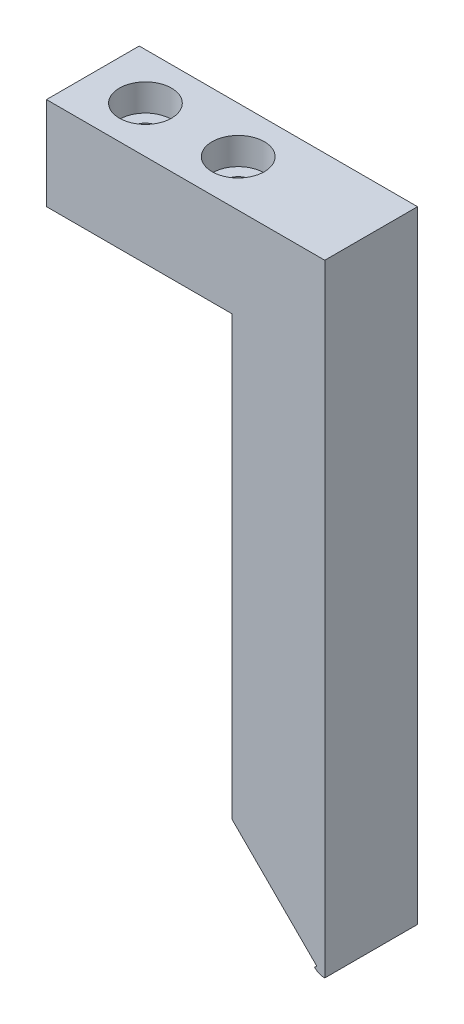
ISO-10303-21;
HEADER;
FILE_DESCRIPTION(('STEP AP214'),'2;1');
FILE_NAME('part.step','',(''),(''),'','','');
FILE_SCHEMA(('AUTOMOTIVE_DESIGN { 1 0 10303 214 1 1 1 1 }'));
ENDSEC;
DATA;
#1=APPLICATION_CONTEXT('core data for automotive mechanical design processes');
#2=APPLICATION_PROTOCOL_DEFINITION('international standard','automotive_design',2000,#1);
#3=PRODUCT_CONTEXT('',#1,'mechanical');
#4=PRODUCT('Part','Part','',(#3));
#5=PRODUCT_RELATED_PRODUCT_CATEGORY('part','',(#4));
#6=PRODUCT_DEFINITION_FORMATION('','',#4);
#7=PRODUCT_DEFINITION_CONTEXT('part definition',#1,'design');
#8=PRODUCT_DEFINITION('design','',#6,#7);
#9=PRODUCT_DEFINITION_SHAPE('','',#8);
#10=(LENGTH_UNIT() NAMED_UNIT(*) SI_UNIT(.MILLI.,.METRE.));
#11=(NAMED_UNIT(*) PLANE_ANGLE_UNIT() SI_UNIT($,.RADIAN.));
#12=(NAMED_UNIT(*) SI_UNIT($,.STERADIAN.) SOLID_ANGLE_UNIT());
#13=UNCERTAINTY_MEASURE_WITH_UNIT(LENGTH_MEASURE(1.E-05),#10,'distance_accuracy_value','');
#14=(GEOMETRIC_REPRESENTATION_CONTEXT(3) GLOBAL_UNCERTAINTY_ASSIGNED_CONTEXT((#13)) GLOBAL_UNIT_ASSIGNED_CONTEXT((#10,
#11,#12)) REPRESENTATION_CONTEXT('',''));
#15=CARTESIAN_POINT('',(0.,0.,0.));
#16=DIRECTION('',(0.,0.,1.));
#17=DIRECTION('',(1.,0.,0.));
#18=AXIS2_PLACEMENT_3D('',#15,#16,#17);
#19=CARTESIAN_POINT('',(0.,0.,6.35));
#20=DIRECTION('',(1.,0.,0.));
#21=DIRECTION('',(0.,1.,0.));
#22=AXIS2_PLACEMENT_3D('',#19,#20,#21);
#23=PLANE('',#22);
#24=DIRECTION('',(0.,-1.,0.));
#25=VECTOR('',#24,1.);
#26=CARTESIAN_POINT('',(0.,0.,-6.35));
#27=LINE('',#26,#25);
#28=CARTESIAN_POINT('',(0.,0.,-6.35));
#29=VERTEX_POINT('',#28);
#30=CARTESIAN_POINT('',(0.,-12.7,-6.35));
#31=VERTEX_POINT('',#30);
#32=EDGE_CURVE('E186',#29,#31,#27,.T.);
#33=ORIENTED_EDGE('',*,*,#32,.T.);
#34=DIRECTION('',(0.,0.,1.));
#35=VECTOR('',#34,1.);
#36=CARTESIAN_POINT('',(0.,-12.7,-6.35));
#37=LINE('',#36,#35);
#38=CARTESIAN_POINT('',(0.,-12.7,6.35));
#39=VERTEX_POINT('',#38);
#40=EDGE_CURVE('E183',#31,#39,#37,.T.);
#41=ORIENTED_EDGE('',*,*,#40,.T.);
#42=DIRECTION('',(0.,-1.,0.));
#43=VECTOR('',#42,1.);
#44=CARTESIAN_POINT('',(0.,0.,6.35));
#45=LINE('',#44,#43);
#46=CARTESIAN_POINT('',(0.,0.,6.35));
#47=VERTEX_POINT('',#46);
#48=EDGE_CURVE('E189',#47,#39,#45,.T.);
#49=ORIENTED_EDGE('',*,*,#48,.F.);
#50=DIRECTION('',(0.,0.,-1.));
#51=VECTOR('',#50,1.);
#52=CARTESIAN_POINT('',(0.,0.,6.35));
#53=LINE('',#52,#51);
#54=EDGE_CURVE('E199',#47,#29,#53,.T.);
#55=ORIENTED_EDGE('',*,*,#54,.T.);
#56=EDGE_LOOP('',(#33,#41,#49,#55));
#57=FACE_BOUND('',#56,.T.);
#58=ADVANCED_FACE('F36',(#57),#23,.F.);
#59=CARTESIAN_POINT('',(0.,-85.1,6.35));
#60=DIRECTION('',(0.,1.,0.));
#61=DIRECTION('',(0.,0.,1.));
#62=AXIS2_PLACEMENT_3D('',#59,#60,#61);
#63=PLANE('',#62);
#64=DIRECTION('',(1.,0.,0.));
#65=VECTOR('',#64,1.);
#66=CARTESIAN_POINT('',(0.,-85.1,6.35));
#67=LINE('',#66,#65);
#68=CARTESIAN_POINT('',(38.,-85.1,6.35));
#69=VERTEX_POINT('',#68);
#70=CARTESIAN_POINT('',(38.1,-85.1,6.35));
#71=VERTEX_POINT('',#70);
#72=EDGE_CURVE('E192',#69,#71,#67,.T.);
#73=ORIENTED_EDGE('',*,*,#72,.F.);
#74=DIRECTION('',(0.,0.,1.));
#75=VECTOR('',#74,1.);
#76=CARTESIAN_POINT('',(38.,-85.1,-6.351));
#77=LINE('',#76,#75);
#78=CARTESIAN_POINT('',(38.,-85.1,-6.35));
#79=VERTEX_POINT('',#78);
#80=EDGE_CURVE('E137',#79,#69,#77,.T.);
#81=ORIENTED_EDGE('',*,*,#80,.F.);
#82=DIRECTION('',(1.,0.,0.));
#83=VECTOR('',#82,1.);
#84=CARTESIAN_POINT('',(0.,-85.1,-6.35));
#85=LINE('',#84,#83);
#86=CARTESIAN_POINT('',(38.1,-85.1,-6.35));
#87=VERTEX_POINT('',#86);
#88=EDGE_CURVE('E202',#79,#87,#85,.T.);
#89=ORIENTED_EDGE('',*,*,#88,.T.);
#90=DIRECTION('',(0.,0.,-1.));
#91=VECTOR('',#90,1.);
#92=CARTESIAN_POINT('',(38.1,-85.1,6.35));
#93=LINE('',#92,#91);
#94=EDGE_CURVE('E11',#71,#87,#93,.T.);
#95=ORIENTED_EDGE('',*,*,#94,.F.);
#96=EDGE_LOOP('',(#73,#81,#89,#95));
#97=FACE_BOUND('',#96,.T.);
#98=ADVANCED_FACE('F233',(#97),#63,.F.);
#99=CARTESIAN_POINT('',(38.1,0.,6.35));
#100=DIRECTION('',(-1.,0.,0.));
#101=DIRECTION('',(0.,-1.,0.));
#102=AXIS2_PLACEMENT_3D('',#99,#100,#101);
#103=PLANE('',#102);
#104=DIRECTION('',(0.,1.,0.));
#105=VECTOR('',#104,1.);
#106=CARTESIAN_POINT('',(38.1,0.,-6.35));
#107=LINE('',#106,#105);
#108=CARTESIAN_POINT('',(38.1,0.,-6.35));
#109=VERTEX_POINT('',#108);
#110=EDGE_CURVE('E204',#87,#109,#107,.T.);
#111=ORIENTED_EDGE('',*,*,#110,.T.);
#112=DIRECTION('',(0.,0.,-1.));
#113=VECTOR('',#112,1.);
#114=CARTESIAN_POINT('',(38.1,0.,6.35));
#115=LINE('',#114,#113);
#116=CARTESIAN_POINT('',(38.1,0.,6.35));
#117=VERTEX_POINT('',#116);
#118=EDGE_CURVE('E44',#117,#109,#115,.T.);
#119=ORIENTED_EDGE('',*,*,#118,.F.);
#120=DIRECTION('',(0.,1.,0.));
#121=VECTOR('',#120,1.);
#122=CARTESIAN_POINT('',(38.1,0.,6.35));
#123=LINE('',#122,#121);
#124=EDGE_CURVE('E195',#71,#117,#123,.T.);
#125=ORIENTED_EDGE('',*,*,#124,.F.);
#126=ORIENTED_EDGE('',*,*,#94,.T.);
#127=EDGE_LOOP('',(#111,#119,#125,#126));
#128=FACE_BOUND('',#127,.T.);
#129=ADVANCED_FACE('F238',(#128),#103,.F.);
#130=CARTESIAN_POINT('',(0.,0.,6.35));
#131=DIRECTION('',(0.,-1.,0.));
#132=DIRECTION('',(0.,0.,-1.));
#133=AXIS2_PLACEMENT_3D('',#130,#131,#132);
#134=PLANE('',#133);
#135=CARTESIAN_POINT('',(7.2,0.,0.));
#136=DIRECTION('',(0.,1.,0.));
#137=DIRECTION('',(0.,0.,1.));
#138=AXIS2_PLACEMENT_3D('',#135,#136,#137);
#139=CIRCLE('',#138,3.57250999999999);
#140=CARTESIAN_POINT('',(7.2,0.,3.57250999999999));
#141=VERTEX_POINT('',#140);
#142=EDGE_CURVE('E155',#141,#141,#139,.T.);
#143=ORIENTED_EDGE('',*,*,#142,.F.);
#144=EDGE_LOOP('',(#143));
#145=FACE_BOUND('',#144,.T.);
#146=CARTESIAN_POINT('',(19.9,0.,0.));
#147=DIRECTION('',(0.,1.,0.));
#148=DIRECTION('',(0.,0.,1.));
#149=AXIS2_PLACEMENT_3D('',#146,#147,#148);
#150=CIRCLE('',#149,3.57250999999999);
#151=CARTESIAN_POINT('',(19.9,0.,3.57250999999999));
#152=VERTEX_POINT('',#151);
#153=EDGE_CURVE('E165',#152,#152,#150,.T.);
#154=ORIENTED_EDGE('',*,*,#153,.F.);
#155=EDGE_LOOP('',(#154));
#156=FACE_BOUND('',#155,.T.);
#157=DIRECTION('',(-1.,0.,0.));
#158=VECTOR('',#157,1.);
#159=CARTESIAN_POINT('',(0.,0.,-6.35));
#160=LINE('',#159,#158);
#161=EDGE_CURVE('E193',#109,#29,#160,.T.);
#162=ORIENTED_EDGE('',*,*,#161,.T.);
#163=ORIENTED_EDGE('',*,*,#54,.F.);
#164=DIRECTION('',(-1.,0.,0.));
#165=VECTOR('',#164,1.);
#166=CARTESIAN_POINT('',(0.,0.,6.35));
#167=LINE('',#166,#165);
#168=EDGE_CURVE('E197',#117,#47,#167,.T.);
#169=ORIENTED_EDGE('',*,*,#168,.F.);
#170=ORIENTED_EDGE('',*,*,#118,.T.);
#171=EDGE_LOOP('',(#162,#163,#169,#170));
#172=FACE_BOUND('',#171,.T.);
#173=ADVANCED_FACE('F257',(#145,#156,#172),#134,.F.);
#174=CARTESIAN_POINT('',(0.,-85.1,6.35));
#175=DIRECTION('',(0.,0.,1.));
#176=DIRECTION('',(1.,0.,0.));
#177=AXIS2_PLACEMENT_3D('',#174,#175,#176);
#178=PLANE('',#177);
#179=DIRECTION('',(-0.707106781186544,0.707106781186551,0.));
#180=VECTOR('',#179,1.);
#181=CARTESIAN_POINT('',(37.0015425820953,-84.2343145750508,6.35));
#182=LINE('',#181,#180);
#183=CARTESIAN_POINT('',(37.0015425820953,-84.2343145750508,6.35));
#184=VERTEX_POINT('',#183);
#185=CARTESIAN_POINT('',(25.4,-72.6327719929553,6.35));
#186=VERTEX_POINT('',#185);
#187=EDGE_CURVE('E52',#184,#186,#182,.T.);
#188=ORIENTED_EDGE('',*,*,#187,.F.);
#189=DIRECTION('',(0.707106781186547,0.707106781186547,0.));
#190=VECTOR('',#189,1.);
#191=CARTESIAN_POINT('',(36.7186998696207,-84.5171572875254,6.35));
#192=LINE('',#191,#190);
#193=CARTESIAN_POINT('',(36.7186998696207,-84.5171572875254,6.35));
#194=VERTEX_POINT('',#193);
#195=EDGE_CURVE('E148',#194,#184,#192,.T.);
#196=ORIENTED_EDGE('',*,*,#195,.F.);
#197=CARTESIAN_POINT('',(38.,-83.4001969406274,6.35));
#198=DIRECTION('',(0.,0.,-1.));
#199=DIRECTION('',(-1.,0.,0.));
#200=AXIS2_PLACEMENT_3D('',#197,#198,#199);
#201=CIRCLE('',#200,1.69980305937263);
#202=EDGE_CURVE('E145',#69,#194,#201,.T.);
#203=ORIENTED_EDGE('',*,*,#202,.F.);
#204=ORIENTED_EDGE('',*,*,#72,.T.);
#205=ORIENTED_EDGE('',*,*,#124,.T.);
#206=ORIENTED_EDGE('',*,*,#168,.T.);
#207=ORIENTED_EDGE('',*,*,#48,.T.);
#208=DIRECTION('',(-1.,0.,0.));
#209=VECTOR('',#208,1.);
#210=CARTESIAN_POINT('',(0.,-12.7,6.35));
#211=LINE('',#210,#209);
#212=CARTESIAN_POINT('',(25.4,-12.7,6.35));
#213=VERTEX_POINT('',#212);
#214=EDGE_CURVE('E177',#213,#39,#211,.T.);
#215=ORIENTED_EDGE('',*,*,#214,.F.);
#216=DIRECTION('',(0.,1.,0.));
#217=VECTOR('',#216,1.);
#218=CARTESIAN_POINT('',(25.4,-85.1,6.35));
#219=LINE('',#218,#217);
#220=EDGE_CURVE('E180',#186,#213,#219,.T.);
#221=ORIENTED_EDGE('',*,*,#220,.F.);
#222=EDGE_LOOP('',(#188,#196,#203,#204,#205,#206,#207,#215,#221));
#223=FACE_BOUND('',#222,.T.);
#224=ADVANCED_FACE('F251',(#223),#178,.T.);
#225=CARTESIAN_POINT('',(0.,-85.1,-6.35));
#226=DIRECTION('',(0.,0.,1.));
#227=DIRECTION('',(1.,0.,0.));
#228=AXIS2_PLACEMENT_3D('',#225,#226,#227);
#229=PLANE('',#228);
#230=DIRECTION('',(-0.707106781186548,-0.707106781186548,0.));
#231=VECTOR('',#230,1.);
#232=CARTESIAN_POINT('',(36.7186998696207,-84.5171572875254,-6.35));
#233=LINE('',#232,#231);
#234=CARTESIAN_POINT('',(37.0015425820953,-84.2343145750508,-6.35));
#235=VERTEX_POINT('',#234);
#236=CARTESIAN_POINT('',(36.7186998696207,-84.5171572875254,-6.35));
#237=VERTEX_POINT('',#236);
#238=EDGE_CURVE('E141',#235,#237,#233,.T.);
#239=ORIENTED_EDGE('',*,*,#238,.F.);
#240=DIRECTION('',(0.707106781186544,-0.707106781186551,0.));
#241=VECTOR('',#240,1.);
#242=CARTESIAN_POINT('',(37.0015425820953,-84.2343145750508,-6.35));
#243=LINE('',#242,#241);
#244=CARTESIAN_POINT('',(25.4,-72.6327719929553,-6.35));
#245=VERTEX_POINT('',#244);
#246=EDGE_CURVE('E143',#245,#235,#243,.T.);
#247=ORIENTED_EDGE('',*,*,#246,.F.);
#248=DIRECTION('',(0.,1.,0.));
#249=VECTOR('',#248,1.);
#250=CARTESIAN_POINT('',(25.4,-85.1,-6.35));
#251=LINE('',#250,#249);
#252=CARTESIAN_POINT('',(25.4,-12.7,-6.35));
#253=VERTEX_POINT('',#252);
#254=EDGE_CURVE('E60',#245,#253,#251,.T.);
#255=ORIENTED_EDGE('',*,*,#254,.T.);
#256=DIRECTION('',(-1.,0.,0.));
#257=VECTOR('',#256,1.);
#258=CARTESIAN_POINT('',(0.,-12.7,-6.35));
#259=LINE('',#258,#257);
#260=EDGE_CURVE('E176',#253,#31,#259,.T.);
#261=ORIENTED_EDGE('',*,*,#260,.T.);
#262=ORIENTED_EDGE('',*,*,#32,.F.);
#263=ORIENTED_EDGE('',*,*,#161,.F.);
#264=ORIENTED_EDGE('',*,*,#110,.F.);
#265=ORIENTED_EDGE('',*,*,#88,.F.);
#266=CARTESIAN_POINT('',(38.,-83.4001969406274,-6.35));
#267=DIRECTION('',(0.,0.,1.));
#268=DIRECTION('',(1.,0.,0.));
#269=AXIS2_PLACEMENT_3D('',#266,#267,#268);
#270=CIRCLE('',#269,1.69980305937263);
#271=EDGE_CURVE('E139',#237,#79,#270,.T.);
#272=ORIENTED_EDGE('',*,*,#271,.F.);
#273=EDGE_LOOP('',(#239,#247,#255,#261,#262,#263,#264,#265,#272));
#274=FACE_BOUND('',#273,.T.);
#275=ADVANCED_FACE('F245',(#274),#229,.F.);
#276=CARTESIAN_POINT('',(0.,-12.7,-6.35));
#277=DIRECTION('',(0.,1.,0.));
#278=DIRECTION('',(0.,0.,1.));
#279=AXIS2_PLACEMENT_3D('',#276,#277,#278);
#280=PLANE('',#279);
#281=CARTESIAN_POINT('',(7.2,-12.7,0.));
#282=DIRECTION('',(0.,1.,0.));
#283=DIRECTION('',(0.,0.,1.));
#284=AXIS2_PLACEMENT_3D('',#281,#282,#283);
#285=CIRCLE('',#284,1.89864999999999);
#286=CARTESIAN_POINT('',(7.2,-12.7,1.89864999999999));
#287=VERTEX_POINT('',#286);
#288=EDGE_CURVE('E39',#287,#287,#285,.T.);
#289=ORIENTED_EDGE('',*,*,#288,.T.);
#290=EDGE_LOOP('',(#289));
#291=FACE_BOUND('',#290,.T.);
#292=CARTESIAN_POINT('',(19.9,-12.7,0.));
#293=DIRECTION('',(0.,1.,0.));
#294=DIRECTION('',(0.,0.,1.));
#295=AXIS2_PLACEMENT_3D('',#292,#293,#294);
#296=CIRCLE('',#295,1.89864999999999);
#297=CARTESIAN_POINT('',(19.9,-12.7,1.89864999999999));
#298=VERTEX_POINT('',#297);
#299=EDGE_CURVE('E174',#298,#298,#296,.T.);
#300=ORIENTED_EDGE('',*,*,#299,.T.);
#301=EDGE_LOOP('',(#300));
#302=FACE_BOUND('',#301,.T.);
#303=ORIENTED_EDGE('',*,*,#214,.T.);
#304=ORIENTED_EDGE('',*,*,#40,.F.);
#305=ORIENTED_EDGE('',*,*,#260,.F.);
#306=DIRECTION('',(0.,0.,1.));
#307=VECTOR('',#306,1.);
#308=CARTESIAN_POINT('',(25.4,-12.7,-6.35));
#309=LINE('',#308,#307);
#310=EDGE_CURVE('E179',#253,#213,#309,.T.);
#311=ORIENTED_EDGE('',*,*,#310,.T.);
#312=EDGE_LOOP('',(#303,#304,#305,#311));
#313=FACE_BOUND('',#312,.T.);
#314=ADVANCED_FACE('F213',(#291,#302,#313),#280,.F.);
#315=CARTESIAN_POINT('',(25.4,-85.1,-6.35));
#316=DIRECTION('',(1.,0.,0.));
#317=DIRECTION('',(0.,1.,0.));
#318=AXIS2_PLACEMENT_3D('',#315,#316,#317);
#319=PLANE('',#318);
#320=ORIENTED_EDGE('',*,*,#254,.F.);
#321=DIRECTION('',(0.,0.,-1.));
#322=VECTOR('',#321,1.);
#323=CARTESIAN_POINT('',(25.4,-72.6327719929553,-6.351));
#324=LINE('',#323,#322);
#325=EDGE_CURVE('E135',#186,#245,#324,.T.);
#326=ORIENTED_EDGE('',*,*,#325,.F.);
#327=ORIENTED_EDGE('',*,*,#220,.T.);
#328=ORIENTED_EDGE('',*,*,#310,.F.);
#329=EDGE_LOOP('',(#320,#326,#327,#328));
#330=FACE_BOUND('',#329,.T.);
#331=ADVANCED_FACE('F219',(#330),#319,.F.);
#332=CARTESIAN_POINT('',(19.9,0.,0.));
#333=DIRECTION('',(0.,1.,0.));
#334=DIRECTION('',(0.,0.,1.));
#335=AXIS2_PLACEMENT_3D('',#332,#333,#334);
#336=CYLINDRICAL_SURFACE('',#335,1.89864999999999);
#337=CARTESIAN_POINT('',(19.9,-3.7051996,0.));
#338=DIRECTION('',(0.,1.,0.));
#339=DIRECTION('',(0.,0.,1.));
#340=AXIS2_PLACEMENT_3D('',#337,#338,#339);
#341=CIRCLE('',#340,1.89865000000001);
#342=CARTESIAN_POINT('',(19.9,-3.7051996,1.89865000000001));
#343=VERTEX_POINT('',#342);
#344=EDGE_CURVE('E171',#343,#343,#341,.T.);
#345=ORIENTED_EDGE('',*,*,#344,.T.);
#346=EDGE_LOOP('',(#345));
#347=FACE_BOUND('',#346,.T.);
#348=ORIENTED_EDGE('',*,*,#299,.F.);
#349=EDGE_LOOP('',(#348));
#350=FACE_BOUND('',#349,.T.);
#351=ADVANCED_FACE('F216',(#347,#350),#336,.F.);
#352=CARTESIAN_POINT('',(21.79865,-3.7051996,0.));
#353=DIRECTION('',(0.,-1.,0.));
#354=DIRECTION('',(0.,0.,-1.));
#355=AXIS2_PLACEMENT_3D('',#352,#353,#354);
#356=PLANE('',#355);
#357=ORIENTED_EDGE('',*,*,#344,.F.);
#358=EDGE_LOOP('',(#357));
#359=FACE_BOUND('',#358,.T.);
#360=CARTESIAN_POINT('',(19.9,-3.7051996,0.));
#361=DIRECTION('',(0.,1.,0.));
#362=DIRECTION('',(0.,0.,1.));
#363=AXIS2_PLACEMENT_3D('',#360,#361,#362);
#364=CIRCLE('',#363,3.57251);
#365=CARTESIAN_POINT('',(19.9,-3.7051996,3.57251));
#366=VERTEX_POINT('',#365);
#367=EDGE_CURVE('E168',#366,#366,#364,.T.);
#368=ORIENTED_EDGE('',*,*,#367,.T.);
#369=EDGE_LOOP('',(#368));
#370=FACE_BOUND('',#369,.T.);
#371=ADVANCED_FACE('F218',(#359,#370),#356,.F.);
#372=CARTESIAN_POINT('',(19.9,0.,0.));
#373=DIRECTION('',(0.,1.,0.));
#374=DIRECTION('',(0.,0.,1.));
#375=AXIS2_PLACEMENT_3D('',#372,#373,#374);
#376=CYLINDRICAL_SURFACE('',#375,3.57251);
#377=ORIENTED_EDGE('',*,*,#367,.F.);
#378=EDGE_LOOP('',(#377));
#379=FACE_BOUND('',#378,.T.);
#380=ORIENTED_EDGE('',*,*,#153,.T.);
#381=EDGE_LOOP('',(#380));
#382=FACE_BOUND('',#381,.T.);
#383=ADVANCED_FACE('F226',(#379,#382),#376,.F.);
#384=CARTESIAN_POINT('',(7.2,0.,0.));
#385=DIRECTION('',(0.,1.,0.));
#386=DIRECTION('',(0.,0.,1.));
#387=AXIS2_PLACEMENT_3D('',#384,#385,#386);
#388=CYLINDRICAL_SURFACE('',#387,1.89864999999999);
#389=CARTESIAN_POINT('',(7.2,-3.7051996,0.));
#390=DIRECTION('',(0.,1.,0.));
#391=DIRECTION('',(0.,0.,1.));
#392=AXIS2_PLACEMENT_3D('',#389,#390,#391);
#393=CIRCLE('',#392,1.89865000000001);
#394=CARTESIAN_POINT('',(7.2,-3.7051996,1.89865000000001));
#395=VERTEX_POINT('',#394);
#396=EDGE_CURVE('E162',#395,#395,#393,.T.);
#397=ORIENTED_EDGE('',*,*,#396,.T.);
#398=EDGE_LOOP('',(#397));
#399=FACE_BOUND('',#398,.T.);
#400=ORIENTED_EDGE('',*,*,#288,.F.);
#401=EDGE_LOOP('',(#400));
#402=FACE_BOUND('',#401,.T.);
#403=ADVANCED_FACE('F294',(#399,#402),#388,.F.);
#404=CARTESIAN_POINT('',(9.09865000000001,-3.7051996,0.));
#405=DIRECTION('',(0.,-1.,0.));
#406=DIRECTION('',(0.,0.,-1.));
#407=AXIS2_PLACEMENT_3D('',#404,#405,#406);
#408=PLANE('',#407);
#409=ORIENTED_EDGE('',*,*,#396,.F.);
#410=EDGE_LOOP('',(#409));
#411=FACE_BOUND('',#410,.T.);
#412=CARTESIAN_POINT('',(7.2,-3.7051996,0.));
#413=DIRECTION('',(0.,1.,0.));
#414=DIRECTION('',(0.,0.,1.));
#415=AXIS2_PLACEMENT_3D('',#412,#413,#414);
#416=CIRCLE('',#415,3.57251);
#417=CARTESIAN_POINT('',(7.2,-3.7051996,3.57251));
#418=VERTEX_POINT('',#417);
#419=EDGE_CURVE('E159',#418,#418,#416,.T.);
#420=ORIENTED_EDGE('',*,*,#419,.T.);
#421=EDGE_LOOP('',(#420));
#422=FACE_BOUND('',#421,.T.);
#423=ADVANCED_FACE('F281',(#411,#422),#408,.F.);
#424=CARTESIAN_POINT('',(7.2,0.,0.));
#425=DIRECTION('',(0.,1.,0.));
#426=DIRECTION('',(0.,0.,1.));
#427=AXIS2_PLACEMENT_3D('',#424,#425,#426);
#428=CYLINDRICAL_SURFACE('',#427,3.57251);
#429=ORIENTED_EDGE('',*,*,#419,.F.);
#430=EDGE_LOOP('',(#429));
#431=FACE_BOUND('',#430,.T.);
#432=ORIENTED_EDGE('',*,*,#142,.T.);
#433=EDGE_LOOP('',(#432));
#434=FACE_BOUND('',#433,.T.);
#435=ADVANCED_FACE('F273',(#431,#434),#428,.F.);
#436=CARTESIAN_POINT('',(37.0015425820953,-84.2343145750508,-6.351));
#437=DIRECTION('',(0.707106781186551,0.707106781186544,0.));
#438=DIRECTION('',(-0.707106781186544,0.707106781186551,0.));
#439=AXIS2_PLACEMENT_3D('',#436,#437,#438);
#440=PLANE('',#439);
#441=CARTESIAN_POINT('',(31.3586140035225,-78.5913859964779,3.17500000000001));
#442=DIRECTION('',(-0.707106781186551,-0.707106781186544,0.));
#443=DIRECTION('',(0.707106781186544,-0.707106781186551,0.));
#444=AXIS2_PLACEMENT_3D('',#441,#442,#443);
#445=CIRCLE('',#444,1.1303);
#446=CARTESIAN_POINT('',(32.1578567982977,-79.390628791253,3.17500000000001));
#447=VERTEX_POINT('',#446);
#448=EDGE_CURVE('E125',#447,#447,#445,.T.);
#449=ORIENTED_EDGE('',*,*,#448,.F.);
#450=EDGE_LOOP('',(#449));
#451=FACE_BOUND('',#450,.T.);
#452=CARTESIAN_POINT('',(31.3586140035225,-78.5913859964779,-3.17500000000001));
#453=DIRECTION('',(-0.707106781186551,-0.707106781186544,0.));
#454=DIRECTION('',(0.707106781186544,-0.707106781186551,0.));
#455=AXIS2_PLACEMENT_3D('',#452,#453,#454);
#456=CIRCLE('',#455,1.1303);
#457=CARTESIAN_POINT('',(32.1578567982977,-79.390628791253,-3.17500000000001));
#458=VERTEX_POINT('',#457);
#459=EDGE_CURVE('E124',#458,#458,#456,.T.);
#460=ORIENTED_EDGE('',*,*,#459,.F.);
#461=EDGE_LOOP('',(#460));
#462=FACE_BOUND('',#461,.T.);
#463=ORIENTED_EDGE('',*,*,#246,.T.);
#464=DIRECTION('',(0.,0.,1.));
#465=VECTOR('',#464,1.);
#466=CARTESIAN_POINT('',(37.0015425820953,-84.2343145750508,-6.351));
#467=LINE('',#466,#465);
#468=EDGE_CURVE('E153',#235,#184,#467,.T.);
#469=ORIENTED_EDGE('',*,*,#468,.T.);
#470=ORIENTED_EDGE('',*,*,#187,.T.);
#471=ORIENTED_EDGE('',*,*,#325,.T.);
#472=EDGE_LOOP('',(#463,#469,#470,#471));
#473=FACE_BOUND('',#472,.T.);
#474=ADVANCED_FACE('F271',(#451,#462,#473),#440,.F.);
#475=CARTESIAN_POINT('',(36.7186998696207,-84.5171572875254,-6.351));
#476=DIRECTION('',(0.707106781186548,-0.707106781186548,0.));
#477=DIRECTION('',(0.707106781186548,0.707106781186548,0.));
#478=AXIS2_PLACEMENT_3D('',#475,#476,#477);
#479=PLANE('',#478);
#480=ORIENTED_EDGE('',*,*,#238,.T.);
#481=DIRECTION('',(0.,0.,1.));
#482=VECTOR('',#481,1.);
#483=CARTESIAN_POINT('',(36.7186998696207,-84.5171572875254,-6.351));
#484=LINE('',#483,#482);
#485=EDGE_CURVE('E152',#237,#194,#484,.T.);
#486=ORIENTED_EDGE('',*,*,#485,.T.);
#487=ORIENTED_EDGE('',*,*,#195,.T.);
#488=ORIENTED_EDGE('',*,*,#468,.F.);
#489=EDGE_LOOP('',(#480,#486,#487,#488));
#490=FACE_BOUND('',#489,.T.);
#491=ADVANCED_FACE('F270',(#490),#479,.F.);
#492=CARTESIAN_POINT('',(38.,-83.4001969406274,-6.351));
#493=DIRECTION('',(0.,0.,1.));
#494=DIRECTION('',(1.,0.,0.));
#495=AXIS2_PLACEMENT_3D('',#492,#493,#494);
#496=CYLINDRICAL_SURFACE('',#495,1.69980305937263);
#497=ORIENTED_EDGE('',*,*,#271,.T.);
#498=ORIENTED_EDGE('',*,*,#80,.T.);
#499=ORIENTED_EDGE('',*,*,#202,.T.);
#500=ORIENTED_EDGE('',*,*,#485,.F.);
#501=EDGE_LOOP('',(#497,#498,#499,#500));
#502=FACE_BOUND('',#501,.T.);
#503=ADVANCED_FACE('F266',(#502),#496,.T.);
#504=CARTESIAN_POINT('',(35.7285339112554,-74.221466088745,-3.17500000000001));
#505=DIRECTION('',(-0.707106781186551,-0.707106781186544,0.));
#506=DIRECTION('',(0.707106781186544,-0.707106781186551,0.));
#507=AXIS2_PLACEMENT_3D('',#504,#505,#506);
#508=CONICAL_SURFACE('',#507,1.1303,1.02974425867666);
#509=CARTESIAN_POINT('',(36.2087674316773,-73.7412325683231,-3.17500000000001));
#510=VERTEX_POINT('',#509);
#511=VERTEX_LOOP('',#510);
#512=FACE_BOUND('',#511,.T.);
#513=CARTESIAN_POINT('',(35.7285339112554,-74.221466088745,-3.17500000000001));
#514=DIRECTION('',(-0.707106781186551,-0.707106781186544,0.));
#515=DIRECTION('',(0.707106781186544,-0.707106781186551,0.));
#516=AXIS2_PLACEMENT_3D('',#513,#514,#515);
#517=CIRCLE('',#516,1.1303);
#518=CARTESIAN_POINT('',(36.5277767060306,-75.0207088835202,-3.17500000000001));
#519=VERTEX_POINT('',#518);
#520=EDGE_CURVE('E128',#519,#519,#517,.T.);
#521=ORIENTED_EDGE('',*,*,#520,.T.);
#522=EDGE_LOOP('',(#521));
#523=FACE_BOUND('',#522,.T.);
#524=ADVANCED_FACE('F287',(#512,#523),#508,.F.);
#525=CARTESIAN_POINT('',(31.3586140035225,-78.5913859964779,-3.17500000000001));
#526=DIRECTION('',(-0.707106781186551,-0.707106781186544,0.));
#527=DIRECTION('',(0.707106781186544,-0.707106781186551,0.));
#528=AXIS2_PLACEMENT_3D('',#525,#526,#527);
#529=CYLINDRICAL_SURFACE('',#528,1.1303);
#530=ORIENTED_EDGE('',*,*,#520,.F.);
#531=EDGE_LOOP('',(#530));
#532=FACE_BOUND('',#531,.T.);
#533=ORIENTED_EDGE('',*,*,#459,.T.);
#534=EDGE_LOOP('',(#533));
#535=FACE_BOUND('',#534,.T.);
#536=ADVANCED_FACE('F118',(#532,#535),#529,.F.);
#537=CARTESIAN_POINT('',(35.7285339112554,-74.221466088745,3.17500000000001));
#538=DIRECTION('',(-0.707106781186551,-0.707106781186544,0.));
#539=DIRECTION('',(0.707106781186544,-0.707106781186551,0.));
#540=AXIS2_PLACEMENT_3D('',#537,#538,#539);
#541=CONICAL_SURFACE('',#540,1.1303,1.02974425867666);
#542=CARTESIAN_POINT('',(36.2087674316773,-73.7412325683231,3.17500000000001));
#543=VERTEX_POINT('',#542);
#544=VERTEX_LOOP('',#543);
#545=FACE_BOUND('',#544,.T.);
#546=CARTESIAN_POINT('',(35.7285339112554,-74.221466088745,3.17500000000001));
#547=DIRECTION('',(-0.707106781186551,-0.707106781186544,0.));
#548=DIRECTION('',(0.707106781186544,-0.707106781186551,0.));
#549=AXIS2_PLACEMENT_3D('',#546,#547,#548);
#550=CIRCLE('',#549,1.1303);
#551=CARTESIAN_POINT('',(36.5277767060306,-75.0207088835202,3.17500000000001));
#552=VERTEX_POINT('',#551);
#553=EDGE_CURVE('E122',#552,#552,#550,.T.);
#554=ORIENTED_EDGE('',*,*,#553,.T.);
#555=EDGE_LOOP('',(#554));
#556=FACE_BOUND('',#555,.T.);
#557=ADVANCED_FACE('F114',(#545,#556),#541,.F.);
#558=CARTESIAN_POINT('',(31.3586140035225,-78.5913859964779,3.17500000000001));
#559=DIRECTION('',(-0.707106781186551,-0.707106781186544,0.));
#560=DIRECTION('',(0.707106781186544,-0.707106781186551,0.));
#561=AXIS2_PLACEMENT_3D('',#558,#559,#560);
#562=CYLINDRICAL_SURFACE('',#561,1.1303);
#563=ORIENTED_EDGE('',*,*,#553,.F.);
#564=EDGE_LOOP('',(#563));
#565=FACE_BOUND('',#564,.T.);
#566=ORIENTED_EDGE('',*,*,#448,.T.);
#567=EDGE_LOOP('',(#566));
#568=FACE_BOUND('',#567,.T.);
#569=ADVANCED_FACE('F117',(#565,#568),#562,.F.);
#570=CLOSED_SHELL('',(#58,#98,#129,#173,#224,#275,#314,#331,#351,#371,#383,#403,#423,#435,#474,
#491,#503,#524,#536,#557,#569));
#571=MANIFOLD_SOLID_BREP('B2',#570);
#572=ADVANCED_BREP_SHAPE_REPRESENTATION('',(#18,#571),#14);
#573=SHAPE_DEFINITION_REPRESENTATION(#9,#572);
ENDSEC;
END-ISO-10303-21;
